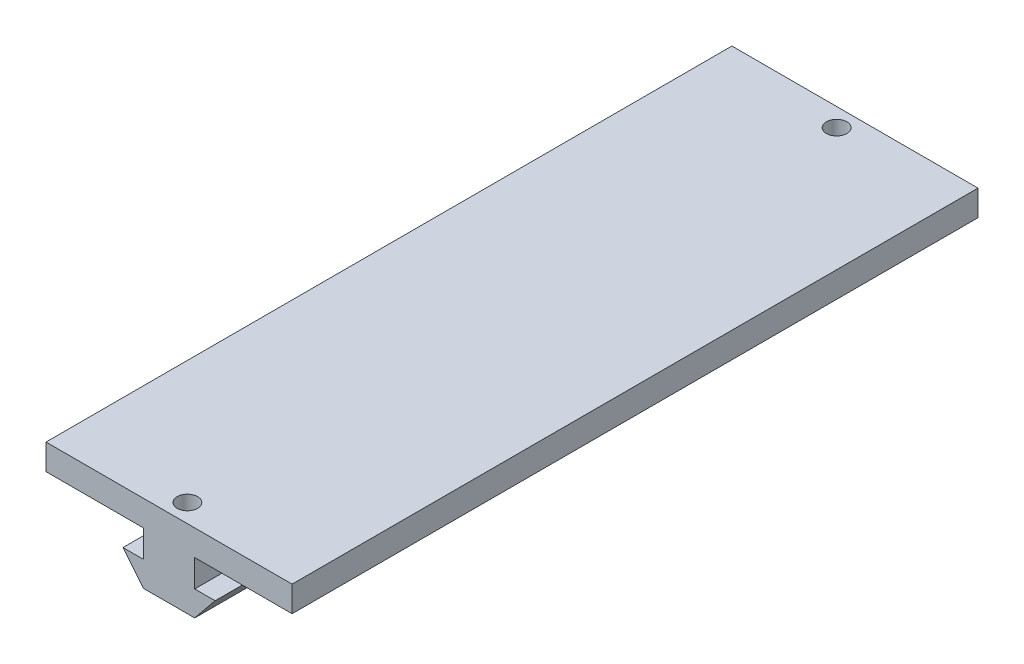
ISO-10303-21;
HEADER;
FILE_DESCRIPTION(('STEP AP214'),'2;1');
FILE_NAME('part.step','',(''),(''),'','','');
FILE_SCHEMA(('AUTOMOTIVE_DESIGN { 1 0 10303 214 1 1 1 1 }'));
ENDSEC;
DATA;
#1=APPLICATION_CONTEXT('core data for automotive mechanical design processes');
#2=APPLICATION_PROTOCOL_DEFINITION('international standard','automotive_design',2000,#1);
#3=PRODUCT_CONTEXT('',#1,'mechanical');
#4=PRODUCT('Part','Part','',(#3));
#5=PRODUCT_RELATED_PRODUCT_CATEGORY('part','',(#4));
#6=PRODUCT_DEFINITION_FORMATION('','',#4);
#7=PRODUCT_DEFINITION_CONTEXT('part definition',#1,'design');
#8=PRODUCT_DEFINITION('design','',#6,#7);
#9=PRODUCT_DEFINITION_SHAPE('','',#8);
#10=(LENGTH_UNIT() NAMED_UNIT(*) SI_UNIT(.MILLI.,.METRE.));
#11=(NAMED_UNIT(*) PLANE_ANGLE_UNIT() SI_UNIT($,.RADIAN.));
#12=(NAMED_UNIT(*) SI_UNIT($,.STERADIAN.) SOLID_ANGLE_UNIT());
#13=UNCERTAINTY_MEASURE_WITH_UNIT(LENGTH_MEASURE(1.E-05),#10,'distance_accuracy_value','');
#14=(GEOMETRIC_REPRESENTATION_CONTEXT(3) GLOBAL_UNCERTAINTY_ASSIGNED_CONTEXT((#13)) GLOBAL_UNIT_ASSIGNED_CONTEXT((#10,
#11,#12)) REPRESENTATION_CONTEXT('',''));
#15=CARTESIAN_POINT('',(0.,0.,0.));
#16=DIRECTION('',(0.,0.,1.));
#17=DIRECTION('',(1.,0.,0.));
#18=AXIS2_PLACEMENT_3D('',#15,#16,#17);
#19=CARTESIAN_POINT('',(23.5,4.9,65.5));
#20=DIRECTION('',(-1.,0.,0.));
#21=DIRECTION('',(0.,0.,1.));
#22=AXIS2_PLACEMENT_3D('',#19,#20,#21);
#23=PLANE('',#22);
#24=DIRECTION('',(0.,0.,-1.));
#25=VECTOR('',#24,1.);
#26=CARTESIAN_POINT('',(23.5,0.,65.5));
#27=LINE('',#26,#25);
#28=CARTESIAN_POINT('',(23.5,0.,65.5));
#29=VERTEX_POINT('',#28);
#30=CARTESIAN_POINT('',(23.5,0.,-65.5));
#31=VERTEX_POINT('',#30);
#32=EDGE_CURVE('E199',#29,#31,#27,.T.);
#33=ORIENTED_EDGE('',*,*,#32,.T.);
#34=DIRECTION('',(0.,-1.,0.));
#35=VECTOR('',#34,1.);
#36=CARTESIAN_POINT('',(23.5,4.9,-65.5));
#37=LINE('',#36,#35);
#38=CARTESIAN_POINT('',(23.5,4.9,-65.5));
#39=VERTEX_POINT('',#38);
#40=EDGE_CURVE('E11',#39,#31,#37,.T.);
#41=ORIENTED_EDGE('',*,*,#40,.F.);
#42=DIRECTION('',(0.,0.,-1.));
#43=VECTOR('',#42,1.);
#44=CARTESIAN_POINT('',(23.5,4.9,65.5));
#45=LINE('',#44,#43);
#46=CARTESIAN_POINT('',(23.5,4.9,65.5));
#47=VERTEX_POINT('',#46);
#48=EDGE_CURVE('E211',#47,#39,#45,.T.);
#49=ORIENTED_EDGE('',*,*,#48,.F.);
#50=DIRECTION('',(0.,-1.,0.));
#51=VECTOR('',#50,1.);
#52=CARTESIAN_POINT('',(23.5,4.9,65.5));
#53=LINE('',#52,#51);
#54=EDGE_CURVE('E218',#47,#29,#53,.T.);
#55=ORIENTED_EDGE('',*,*,#54,.T.);
#56=EDGE_LOOP('',(#33,#41,#49,#55));
#57=FACE_BOUND('',#56,.T.);
#58=ADVANCED_FACE('F43',(#57),#23,.F.);
#59=CARTESIAN_POINT('',(-23.5,4.9,-65.5));
#60=DIRECTION('',(0.,0.,1.));
#61=DIRECTION('',(1.,0.,0.));
#62=AXIS2_PLACEMENT_3D('',#59,#60,#61);
#63=PLANE('',#62);
#64=DIRECTION('',(-1.,0.,0.));
#65=VECTOR('',#64,1.);
#66=CARTESIAN_POINT('',(-23.5,0.,-65.5));
#67=LINE('',#66,#65);
#68=CARTESIAN_POINT('',(-23.5,0.,-65.5));
#69=VERTEX_POINT('',#68);
#70=EDGE_CURVE('E221',#31,#69,#67,.T.);
#71=ORIENTED_EDGE('',*,*,#70,.T.);
#72=DIRECTION('',(0.,-1.,0.));
#73=VECTOR('',#72,1.);
#74=CARTESIAN_POINT('',(-23.5,4.9,-65.5));
#75=LINE('',#74,#73);
#76=CARTESIAN_POINT('',(-23.5,4.9,-65.5));
#77=VERTEX_POINT('',#76);
#78=EDGE_CURVE('E51',#77,#69,#75,.T.);
#79=ORIENTED_EDGE('',*,*,#78,.F.);
#80=DIRECTION('',(-1.,0.,0.));
#81=VECTOR('',#80,1.);
#82=CARTESIAN_POINT('',(-23.5,4.9,-65.5));
#83=LINE('',#82,#81);
#84=EDGE_CURVE('E95',#39,#77,#83,.T.);
#85=ORIENTED_EDGE('',*,*,#84,.F.);
#86=ORIENTED_EDGE('',*,*,#40,.T.);
#87=EDGE_LOOP('',(#71,#79,#85,#86));
#88=FACE_BOUND('',#87,.T.);
#89=ADVANCED_FACE('F262',(#88),#63,.F.);
#90=CARTESIAN_POINT('',(-23.5,4.9,65.5));
#91=DIRECTION('',(1.,0.,0.));
#92=DIRECTION('',(0.,0.,-1.));
#93=AXIS2_PLACEMENT_3D('',#90,#91,#92);
#94=PLANE('',#93);
#95=DIRECTION('',(0.,0.,1.));
#96=VECTOR('',#95,1.);
#97=CARTESIAN_POINT('',(-23.5,0.,65.5));
#98=LINE('',#97,#96);
#99=CARTESIAN_POINT('',(-23.5,0.,65.5));
#100=VERTEX_POINT('',#99);
#101=EDGE_CURVE('E223',#69,#100,#98,.T.);
#102=ORIENTED_EDGE('',*,*,#101,.T.);
#103=DIRECTION('',(0.,-1.,0.));
#104=VECTOR('',#103,1.);
#105=CARTESIAN_POINT('',(-23.5,4.9,65.5));
#106=LINE('',#105,#104);
#107=CARTESIAN_POINT('',(-23.5,4.9,65.5));
#108=VERTEX_POINT('',#107);
#109=EDGE_CURVE('E228',#108,#100,#106,.T.);
#110=ORIENTED_EDGE('',*,*,#109,.F.);
#111=DIRECTION('',(0.,0.,1.));
#112=VECTOR('',#111,1.);
#113=CARTESIAN_POINT('',(-23.5,4.9,65.5));
#114=LINE('',#113,#112);
#115=EDGE_CURVE('E215',#77,#108,#114,.T.);
#116=ORIENTED_EDGE('',*,*,#115,.F.);
#117=ORIENTED_EDGE('',*,*,#78,.T.);
#118=EDGE_LOOP('',(#102,#110,#116,#117));
#119=FACE_BOUND('',#118,.T.);
#120=ADVANCED_FACE('F235',(#119),#94,.F.);
#121=CARTESIAN_POINT('',(-23.5,4.9,65.5));
#122=DIRECTION('',(0.,0.,-1.));
#123=DIRECTION('',(-1.,0.,0.));
#124=AXIS2_PLACEMENT_3D('',#121,#122,#123);
#125=PLANE('',#124);
#126=DIRECTION('',(1.,0.,0.));
#127=VECTOR('',#126,1.);
#128=CARTESIAN_POINT('',(-23.5,0.,65.5));
#129=LINE('',#128,#127);
#130=CARTESIAN_POINT('',(-4.9,0.,65.5));
#131=VERTEX_POINT('',#130);
#132=EDGE_CURVE('E213',#100,#131,#129,.T.);
#133=ORIENTED_EDGE('',*,*,#132,.T.);
#134=DIRECTION('',(0.,-1.,0.));
#135=VECTOR('',#134,1.);
#136=CARTESIAN_POINT('',(-4.9,-5.2,65.5));
#137=LINE('',#136,#135);
#138=CARTESIAN_POINT('',(-4.9,-5.2,65.5));
#139=VERTEX_POINT('',#138);
#140=EDGE_CURVE('E58',#131,#139,#137,.T.);
#141=ORIENTED_EDGE('',*,*,#140,.T.);
#142=DIRECTION('',(-1.,0.,0.));
#143=VECTOR('',#142,1.);
#144=CARTESIAN_POINT('',(-8.8,-5.2,65.5));
#145=LINE('',#144,#143);
#146=CARTESIAN_POINT('',(-8.8,-5.2,65.5));
#147=VERTEX_POINT('',#146);
#148=EDGE_CURVE('E146',#139,#147,#145,.T.);
#149=ORIENTED_EDGE('',*,*,#148,.T.);
#150=DIRECTION('',(0.630592625094466,-0.776114000116266,0.));
#151=VECTOR('',#150,1.);
#152=CARTESIAN_POINT('',(-4.9,-10.,65.5));
#153=LINE('',#152,#151);
#154=CARTESIAN_POINT('',(-4.9,-10.,65.5));
#155=VERTEX_POINT('',#154);
#156=EDGE_CURVE('E187',#147,#155,#153,.T.);
#157=ORIENTED_EDGE('',*,*,#156,.T.);
#158=DIRECTION('',(1.,0.,0.));
#159=VECTOR('',#158,1.);
#160=CARTESIAN_POINT('',(4.9,-10.,65.5));
#161=LINE('',#160,#159);
#162=CARTESIAN_POINT('',(4.9,-10.,65.5));
#163=VERTEX_POINT('',#162);
#164=EDGE_CURVE('E190',#155,#163,#161,.T.);
#165=ORIENTED_EDGE('',*,*,#164,.T.);
#166=DIRECTION('',(0.630592625094466,0.776114000116266,0.));
#167=VECTOR('',#166,1.);
#168=CARTESIAN_POINT('',(8.8,-5.2,65.5));
#169=LINE('',#168,#167);
#170=CARTESIAN_POINT('',(8.8,-5.2,65.5));
#171=VERTEX_POINT('',#170);
#172=EDGE_CURVE('E193',#163,#171,#169,.T.);
#173=ORIENTED_EDGE('',*,*,#172,.T.);
#174=DIRECTION('',(-1.,0.,0.));
#175=VECTOR('',#174,1.);
#176=CARTESIAN_POINT('',(4.9,-5.2,65.5));
#177=LINE('',#176,#175);
#178=CARTESIAN_POINT('',(4.9,-5.2,65.5));
#179=VERTEX_POINT('',#178);
#180=EDGE_CURVE('E166',#171,#179,#177,.T.);
#181=ORIENTED_EDGE('',*,*,#180,.T.);
#182=DIRECTION('',(0.,1.,0.));
#183=VECTOR('',#182,1.);
#184=CARTESIAN_POINT('',(4.9,0.,65.5));
#185=LINE('',#184,#183);
#186=CARTESIAN_POINT('',(4.9,0.,65.5));
#187=VERTEX_POINT('',#186);
#188=EDGE_CURVE('E164',#179,#187,#185,.T.);
#189=ORIENTED_EDGE('',*,*,#188,.T.);
#190=EDGE_CURVE('E88',#187,#29,#129,.T.);
#191=ORIENTED_EDGE('',*,*,#190,.T.);
#192=ORIENTED_EDGE('',*,*,#54,.F.);
#193=DIRECTION('',(1.,0.,0.));
#194=VECTOR('',#193,1.);
#195=CARTESIAN_POINT('',(-23.5,4.9,65.5));
#196=LINE('',#195,#194);
#197=EDGE_CURVE('E67',#108,#47,#196,.T.);
#198=ORIENTED_EDGE('',*,*,#197,.F.);
#199=ORIENTED_EDGE('',*,*,#109,.T.);
#200=EDGE_LOOP('',(#133,#141,#149,#157,#165,#173,#181,#189,#191,#192,#198,#199));
#201=FACE_BOUND('',#200,.T.);
#202=ADVANCED_FACE('F242',(#201),#125,.F.);
#203=CARTESIAN_POINT('',(0.,4.9,0.));
#204=DIRECTION('',(0.,-1.,0.));
#205=DIRECTION('',(0.,0.,-1.));
#206=AXIS2_PLACEMENT_3D('',#203,#204,#205);
#207=PLANE('',#206);
#208=CARTESIAN_POINT('',(0.,4.9,-62.));
#209=DIRECTION('',(0.,1.,0.));
#210=DIRECTION('',(0.,0.,1.));
#211=AXIS2_PLACEMENT_3D('',#208,#209,#210);
#212=CIRCLE('',#211,1.95);
#213=CARTESIAN_POINT('',(0.,4.9,-60.05));
#214=VERTEX_POINT('',#213);
#215=EDGE_CURVE('E371',#214,#214,#212,.T.);
#216=ORIENTED_EDGE('',*,*,#215,.F.);
#217=EDGE_LOOP('',(#216));
#218=FACE_BOUND('',#217,.T.);
#219=CARTESIAN_POINT('',(0.,4.9,62.));
#220=DIRECTION('',(0.,1.,0.));
#221=DIRECTION('',(0.,0.,1.));
#222=AXIS2_PLACEMENT_3D('',#219,#220,#221);
#223=CIRCLE('',#222,1.95);
#224=CARTESIAN_POINT('',(0.,4.9,63.95));
#225=VERTEX_POINT('',#224);
#226=EDGE_CURVE('E369',#225,#225,#223,.T.);
#227=ORIENTED_EDGE('',*,*,#226,.F.);
#228=EDGE_LOOP('',(#227));
#229=FACE_BOUND('',#228,.T.);
#230=ORIENTED_EDGE('',*,*,#48,.T.);
#231=ORIENTED_EDGE('',*,*,#84,.T.);
#232=ORIENTED_EDGE('',*,*,#115,.T.);
#233=ORIENTED_EDGE('',*,*,#197,.T.);
#234=EDGE_LOOP('',(#230,#231,#232,#233));
#235=FACE_BOUND('',#234,.T.);
#236=ADVANCED_FACE('F246',(#218,#229,#235),#207,.F.);
#237=CARTESIAN_POINT('',(0.,0.,0.));
#238=DIRECTION('',(0.,-1.,0.));
#239=DIRECTION('',(0.,0.,-1.));
#240=AXIS2_PLACEMENT_3D('',#237,#238,#239);
#241=PLANE('',#240);
#242=CARTESIAN_POINT('',(0.,0.,-62.));
#243=DIRECTION('',(0.,-1.,0.));
#244=DIRECTION('',(0.,0.,-1.));
#245=AXIS2_PLACEMENT_3D('',#242,#243,#244);
#246=CIRCLE('',#245,1.95);
#247=CARTESIAN_POINT('',(0.,0.,-63.95));
#248=VERTEX_POINT('',#247);
#249=EDGE_CURVE('E46',#248,#248,#246,.T.);
#250=ORIENTED_EDGE('',*,*,#249,.F.);
#251=EDGE_LOOP('',(#250));
#252=FACE_BOUND('',#251,.T.);
#253=DIRECTION('',(0.,0.,1.));
#254=VECTOR('',#253,1.);
#255=CARTESIAN_POINT('',(4.9,0.,15.5));
#256=LINE('',#255,#254);
#257=CARTESIAN_POINT('',(4.9,0.,15.5));
#258=VERTEX_POINT('',#257);
#259=EDGE_CURVE('E200',#258,#187,#256,.T.);
#260=ORIENTED_EDGE('',*,*,#259,.F.);
#261=DIRECTION('',(-1.,0.,0.));
#262=VECTOR('',#261,1.);
#263=CARTESIAN_POINT('',(-4.9,0.,15.5));
#264=LINE('',#263,#262);
#265=CARTESIAN_POINT('',(-4.9,0.,15.5));
#266=VERTEX_POINT('',#265);
#267=EDGE_CURVE('E149',#258,#266,#264,.T.);
#268=ORIENTED_EDGE('',*,*,#267,.T.);
#269=DIRECTION('',(0.,0.,1.));
#270=VECTOR('',#269,1.);
#271=CARTESIAN_POINT('',(-4.9,0.,15.5));
#272=LINE('',#271,#270);
#273=EDGE_CURVE('E163',#266,#131,#272,.T.);
#274=ORIENTED_EDGE('',*,*,#273,.T.);
#275=ORIENTED_EDGE('',*,*,#132,.F.);
#276=ORIENTED_EDGE('',*,*,#101,.F.);
#277=ORIENTED_EDGE('',*,*,#70,.F.);
#278=ORIENTED_EDGE('',*,*,#32,.F.);
#279=ORIENTED_EDGE('',*,*,#190,.F.);
#280=EDGE_LOOP('',(#260,#268,#274,#275,#276,#277,#278,#279));
#281=FACE_BOUND('',#280,.T.);
#282=ADVANCED_FACE('F240',(#252,#281),#241,.T.);
#283=CARTESIAN_POINT('',(-4.9,-5.2,15.5));
#284=DIRECTION('',(-1.,0.,0.));
#285=DIRECTION('',(0.,0.,1.));
#286=AXIS2_PLACEMENT_3D('',#283,#284,#285);
#287=PLANE('',#286);
#288=ORIENTED_EDGE('',*,*,#140,.F.);
#289=ORIENTED_EDGE('',*,*,#273,.F.);
#290=DIRECTION('',(0.,-1.,0.));
#291=VECTOR('',#290,1.);
#292=CARTESIAN_POINT('',(-4.9,-5.2,15.5));
#293=LINE('',#292,#291);
#294=CARTESIAN_POINT('',(-4.9,-5.2,15.5));
#295=VERTEX_POINT('',#294);
#296=EDGE_CURVE('E156',#266,#295,#293,.T.);
#297=ORIENTED_EDGE('',*,*,#296,.T.);
#298=DIRECTION('',(0.,0.,1.));
#299=VECTOR('',#298,1.);
#300=CARTESIAN_POINT('',(-4.9,-5.2,15.5));
#301=LINE('',#300,#299);
#302=EDGE_CURVE('E141',#295,#139,#301,.T.);
#303=ORIENTED_EDGE('',*,*,#302,.T.);
#304=EDGE_LOOP('',(#288,#289,#297,#303));
#305=FACE_BOUND('',#304,.T.);
#306=ADVANCED_FACE('F162',(#305),#287,.T.);
#307=CARTESIAN_POINT('',(4.9,0.,15.5));
#308=DIRECTION('',(1.,0.,0.));
#309=DIRECTION('',(0.,0.,-1.));
#310=AXIS2_PLACEMENT_3D('',#307,#308,#309);
#311=PLANE('',#310);
#312=ORIENTED_EDGE('',*,*,#188,.F.);
#313=DIRECTION('',(0.,0.,1.));
#314=VECTOR('',#313,1.);
#315=CARTESIAN_POINT('',(4.9,-5.2,15.5));
#316=LINE('',#315,#314);
#317=CARTESIAN_POINT('',(4.9,-5.2,15.5));
#318=VERTEX_POINT('',#317);
#319=EDGE_CURVE('E202',#318,#179,#316,.T.);
#320=ORIENTED_EDGE('',*,*,#319,.F.);
#321=DIRECTION('',(0.,1.,0.));
#322=VECTOR('',#321,1.);
#323=CARTESIAN_POINT('',(4.9,0.,15.5));
#324=LINE('',#323,#322);
#325=EDGE_CURVE('E182',#318,#258,#324,.T.);
#326=ORIENTED_EDGE('',*,*,#325,.T.);
#327=ORIENTED_EDGE('',*,*,#259,.T.);
#328=EDGE_LOOP('',(#312,#320,#326,#327));
#329=FACE_BOUND('',#328,.T.);
#330=ADVANCED_FACE('F272',(#329),#311,.T.);
#331=CARTESIAN_POINT('',(4.9,-5.2,15.5));
#332=DIRECTION('',(0.,1.,0.));
#333=DIRECTION('',(-1.,0.,0.));
#334=AXIS2_PLACEMENT_3D('',#331,#332,#333);
#335=PLANE('',#334);
#336=ORIENTED_EDGE('',*,*,#180,.F.);
#337=DIRECTION('',(0.,0.,1.));
#338=VECTOR('',#337,1.);
#339=CARTESIAN_POINT('',(8.8,-5.2,15.5));
#340=LINE('',#339,#338);
#341=CARTESIAN_POINT('',(8.8,-5.2,15.5));
#342=VERTEX_POINT('',#341);
#343=EDGE_CURVE('E204',#342,#171,#340,.T.);
#344=ORIENTED_EDGE('',*,*,#343,.F.);
#345=DIRECTION('',(-1.,0.,0.));
#346=VECTOR('',#345,1.);
#347=CARTESIAN_POINT('',(4.9,-5.2,15.5));
#348=LINE('',#347,#346);
#349=EDGE_CURVE('E179',#342,#318,#348,.T.);
#350=ORIENTED_EDGE('',*,*,#349,.T.);
#351=ORIENTED_EDGE('',*,*,#319,.T.);
#352=EDGE_LOOP('',(#336,#344,#350,#351));
#353=FACE_BOUND('',#352,.T.);
#354=ADVANCED_FACE('F277',(#353),#335,.T.);
#355=CARTESIAN_POINT('',(8.8,-5.2,15.5));
#356=DIRECTION('',(0.776114000116266,-0.630592625094466,0.));
#357=DIRECTION('',(0.630592625094466,0.776114000116265,0.));
#358=AXIS2_PLACEMENT_3D('',#355,#356,#357);
#359=PLANE('',#358);
#360=ORIENTED_EDGE('',*,*,#172,.F.);
#361=DIRECTION('',(0.,0.,1.));
#362=VECTOR('',#361,1.);
#363=CARTESIAN_POINT('',(4.9,-10.,15.5));
#364=LINE('',#363,#362);
#365=CARTESIAN_POINT('',(4.9,-10.,15.5));
#366=VERTEX_POINT('',#365);
#367=EDGE_CURVE('E206',#366,#163,#364,.T.);
#368=ORIENTED_EDGE('',*,*,#367,.F.);
#369=DIRECTION('',(0.630592625094466,0.776114000116266,0.));
#370=VECTOR('',#369,1.);
#371=CARTESIAN_POINT('',(8.8,-5.2,15.5));
#372=LINE('',#371,#370);
#373=EDGE_CURVE('E176',#366,#342,#372,.T.);
#374=ORIENTED_EDGE('',*,*,#373,.T.);
#375=ORIENTED_EDGE('',*,*,#343,.T.);
#376=EDGE_LOOP('',(#360,#368,#374,#375));
#377=FACE_BOUND('',#376,.T.);
#378=ADVANCED_FACE('F281',(#377),#359,.T.);
#379=CARTESIAN_POINT('',(4.9,-10.,15.5));
#380=DIRECTION('',(0.,-1.,0.));
#381=DIRECTION('',(1.,0.,0.));
#382=AXIS2_PLACEMENT_3D('',#379,#380,#381);
#383=PLANE('',#382);
#384=ORIENTED_EDGE('',*,*,#164,.F.);
#385=DIRECTION('',(0.,0.,1.));
#386=VECTOR('',#385,1.);
#387=CARTESIAN_POINT('',(-4.9,-10.,15.5));
#388=LINE('',#387,#386);
#389=CARTESIAN_POINT('',(-4.9,-10.,15.5));
#390=VERTEX_POINT('',#389);
#391=EDGE_CURVE('E208',#390,#155,#388,.T.);
#392=ORIENTED_EDGE('',*,*,#391,.F.);
#393=DIRECTION('',(1.,0.,0.));
#394=VECTOR('',#393,1.);
#395=CARTESIAN_POINT('',(4.9,-10.,15.5));
#396=LINE('',#395,#394);
#397=EDGE_CURVE('E173',#390,#366,#396,.T.);
#398=ORIENTED_EDGE('',*,*,#397,.T.);
#399=ORIENTED_EDGE('',*,*,#367,.T.);
#400=EDGE_LOOP('',(#384,#392,#398,#399));
#401=FACE_BOUND('',#400,.T.);
#402=ADVANCED_FACE('F284',(#401),#383,.T.);
#403=CARTESIAN_POINT('',(-4.9,-10.,15.5));
#404=DIRECTION('',(-0.776114000116266,-0.630592625094466,0.));
#405=DIRECTION('',(0.630592625094466,-0.776114000116265,0.));
#406=AXIS2_PLACEMENT_3D('',#403,#404,#405);
#407=PLANE('',#406);
#408=ORIENTED_EDGE('',*,*,#156,.F.);
#409=DIRECTION('',(0.,0.,1.));
#410=VECTOR('',#409,1.);
#411=CARTESIAN_POINT('',(-8.8,-5.2,15.5));
#412=LINE('',#411,#410);
#413=CARTESIAN_POINT('',(-8.8,-5.2,15.5));
#414=VERTEX_POINT('',#413);
#415=EDGE_CURVE('E148',#414,#147,#412,.T.);
#416=ORIENTED_EDGE('',*,*,#415,.F.);
#417=DIRECTION('',(0.630592625094466,-0.776114000116266,0.));
#418=VECTOR('',#417,1.);
#419=CARTESIAN_POINT('',(-4.9,-10.,15.5));
#420=LINE('',#419,#418);
#421=EDGE_CURVE('E160',#414,#390,#420,.T.);
#422=ORIENTED_EDGE('',*,*,#421,.T.);
#423=ORIENTED_EDGE('',*,*,#391,.T.);
#424=EDGE_LOOP('',(#408,#416,#422,#423));
#425=FACE_BOUND('',#424,.T.);
#426=ADVANCED_FACE('F287',(#425),#407,.T.);
#427=CARTESIAN_POINT('',(-8.8,-5.2,15.5));
#428=DIRECTION('',(0.,1.,0.));
#429=DIRECTION('',(0.,0.,1.));
#430=AXIS2_PLACEMENT_3D('',#427,#428,#429);
#431=PLANE('',#430);
#432=ORIENTED_EDGE('',*,*,#148,.F.);
#433=ORIENTED_EDGE('',*,*,#302,.F.);
#434=DIRECTION('',(-1.,0.,0.));
#435=VECTOR('',#434,1.);
#436=CARTESIAN_POINT('',(-8.8,-5.2,15.5));
#437=LINE('',#436,#435);
#438=EDGE_CURVE('E144',#295,#414,#437,.T.);
#439=ORIENTED_EDGE('',*,*,#438,.T.);
#440=ORIENTED_EDGE('',*,*,#415,.T.);
#441=EDGE_LOOP('',(#432,#433,#439,#440));
#442=FACE_BOUND('',#441,.T.);
#443=ADVANCED_FACE('F143',(#442),#431,.T.);
#444=CARTESIAN_POINT('',(0.,0.,15.5));
#445=DIRECTION('',(0.,0.,-1.));
#446=DIRECTION('',(-1.,0.,0.));
#447=AXIS2_PLACEMENT_3D('',#444,#445,#446);
#448=PLANE('',#447);
#449=ORIENTED_EDGE('',*,*,#296,.F.);
#450=ORIENTED_EDGE('',*,*,#267,.F.);
#451=ORIENTED_EDGE('',*,*,#325,.F.);
#452=ORIENTED_EDGE('',*,*,#349,.F.);
#453=ORIENTED_EDGE('',*,*,#373,.F.);
#454=ORIENTED_EDGE('',*,*,#397,.F.);
#455=ORIENTED_EDGE('',*,*,#421,.F.);
#456=ORIENTED_EDGE('',*,*,#438,.F.);
#457=EDGE_LOOP('',(#449,#450,#451,#452,#453,#454,#455,#456));
#458=FACE_BOUND('',#457,.T.);
#459=ADVANCED_FACE('F154',(#458),#448,.T.);
#460=CARTESIAN_POINT('',(0.,-1.1,-62.));
#461=DIRECTION('',(0.,1.,0.));
#462=DIRECTION('',(0.,0.,1.));
#463=AXIS2_PLACEMENT_3D('',#460,#461,#462);
#464=CYLINDRICAL_SURFACE('',#463,1.95);
#465=ORIENTED_EDGE('',*,*,#249,.T.);
#466=EDGE_LOOP('',(#465));
#467=FACE_BOUND('',#466,.T.);
#468=ORIENTED_EDGE('',*,*,#215,.T.);
#469=EDGE_LOOP('',(#468));
#470=FACE_BOUND('',#469,.T.);
#471=ADVANCED_FACE('F337',(#467,#470),#464,.F.);
#472=CARTESIAN_POINT('',(0.,-1.1,62.));
#473=DIRECTION('',(0.,1.,0.));
#474=DIRECTION('',(0.,0.,1.));
#475=AXIS2_PLACEMENT_3D('',#472,#473,#474);
#476=CYLINDRICAL_SURFACE('',#475,1.95);
#477=CARTESIAN_POINT('',(0.,-1.1,62.));
#478=DIRECTION('',(0.,1.,0.));
#479=DIRECTION('',(0.,0.,1.));
#480=AXIS2_PLACEMENT_3D('',#477,#478,#479);
#481=CIRCLE('',#480,1.95);
#482=CARTESIAN_POINT('',(0.,-1.1,63.95));
#483=VERTEX_POINT('',#482);
#484=EDGE_CURVE('E169',#483,#483,#481,.T.);
#485=ORIENTED_EDGE('',*,*,#484,.F.);
#486=EDGE_LOOP('',(#485));
#487=FACE_BOUND('',#486,.T.);
#488=ORIENTED_EDGE('',*,*,#226,.T.);
#489=EDGE_LOOP('',(#488));
#490=FACE_BOUND('',#489,.T.);
#491=ADVANCED_FACE('F345',(#487,#490),#476,.F.);
#492=CARTESIAN_POINT('',(0.,-1.1,62.));
#493=DIRECTION('',(0.,1.,0.));
#494=DIRECTION('',(0.,0.,1.));
#495=AXIS2_PLACEMENT_3D('',#492,#493,#494);
#496=PLANE('',#495);
#497=ORIENTED_EDGE('',*,*,#484,.T.);
#498=EDGE_LOOP('',(#497));
#499=FACE_BOUND('',#498,.T.);
#500=ADVANCED_FACE('F355',(#499),#496,.T.);
#501=CLOSED_SHELL('',(#58,#89,#120,#202,#236,#282,#306,#330,#354,#378,#402,#426,#443,#459,#471,
#491,#500));
#502=MANIFOLD_SOLID_BREP('B2',#501);
#503=ADVANCED_BREP_SHAPE_REPRESENTATION('',(#18,#502),#14);
#504=SHAPE_DEFINITION_REPRESENTATION(#9,#503);
ENDSEC;
END-ISO-10303-21;
